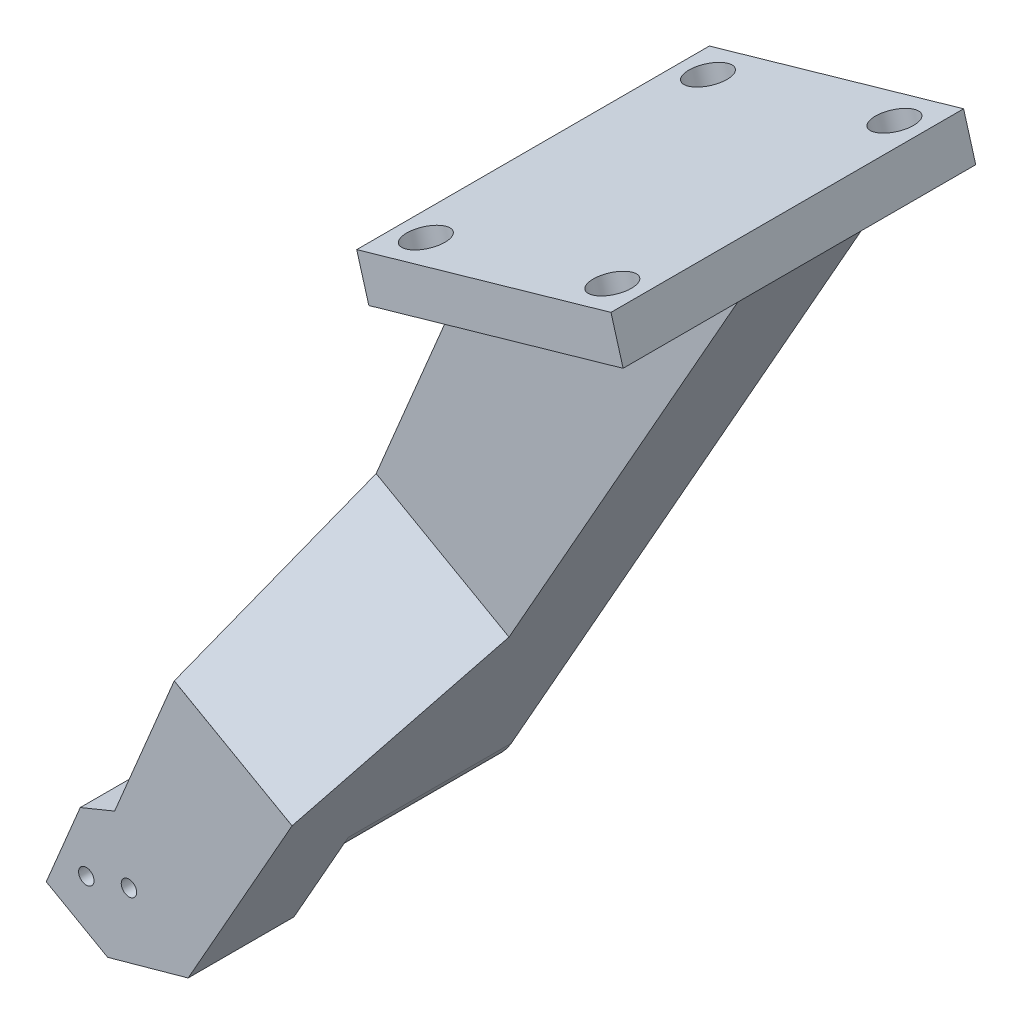
ISO-10303-21;
HEADER;
FILE_DESCRIPTION(('STEP AP214'),'2;1');
FILE_NAME('part.step','',(''),(''),'','','');
FILE_SCHEMA(('AUTOMOTIVE_DESIGN { 1 0 10303 214 1 1 1 1 }'));
ENDSEC;
DATA;
#1=APPLICATION_CONTEXT('core data for automotive mechanical design processes');
#2=APPLICATION_PROTOCOL_DEFINITION('international standard','automotive_design',2000,#1);
#3=PRODUCT_CONTEXT('',#1,'mechanical');
#4=PRODUCT('Part','Part','',(#3));
#5=PRODUCT_RELATED_PRODUCT_CATEGORY('part','',(#4));
#6=PRODUCT_DEFINITION_FORMATION('','',#4);
#7=PRODUCT_DEFINITION_CONTEXT('part definition',#1,'design');
#8=PRODUCT_DEFINITION('design','',#6,#7);
#9=PRODUCT_DEFINITION_SHAPE('','',#8);
#10=(LENGTH_UNIT() NAMED_UNIT(*) SI_UNIT(.MILLI.,.METRE.));
#11=(NAMED_UNIT(*) PLANE_ANGLE_UNIT() SI_UNIT($,.RADIAN.));
#12=(NAMED_UNIT(*) SI_UNIT($,.STERADIAN.) SOLID_ANGLE_UNIT());
#13=UNCERTAINTY_MEASURE_WITH_UNIT(LENGTH_MEASURE(1.E-05),#10,'distance_accuracy_value','');
#14=(GEOMETRIC_REPRESENTATION_CONTEXT(3) GLOBAL_UNCERTAINTY_ASSIGNED_CONTEXT((#13)) GLOBAL_UNIT_ASSIGNED_CONTEXT((#10,
#11,#12)) REPRESENTATION_CONTEXT('',''));
#15=CARTESIAN_POINT('',(0.,0.,0.));
#16=DIRECTION('',(0.,0.,1.));
#17=DIRECTION('',(1.,0.,0.));
#18=AXIS2_PLACEMENT_3D('',#15,#16,#17);
#19=CARTESIAN_POINT('',(27.9355762114051,27.2756145052274,-1.29323704785185));
#20=DIRECTION('',(0.,0.,-1.));
#21=DIRECTION('',(-1.,0.,0.));
#22=AXIS2_PLACEMENT_3D('',#19,#20,#21);
#23=PLANE('',#22);
#24=DIRECTION('',(-0.385881624576734,-0.922548303241635,0.));
#25=VECTOR('',#24,1.);
#26=CARTESIAN_POINT('',(44.8530612739666,85.7177109131975,-1.29323704785185));
#27=LINE('',#26,#25);
#28=CARTESIAN_POINT('',(44.8530612739666,85.7177109131975,-1.29323704785185));
#29=VERTEX_POINT('',#28);
#30=CARTESIAN_POINT('',(32.6840647949093,56.6246255240659,-1.29323704785185));
#31=VERTEX_POINT('',#30);
#32=EDGE_CURVE('E283',#29,#31,#27,.T.);
#33=ORIENTED_EDGE('',*,*,#32,.T.);
#34=DIRECTION('',(0.870454620187236,-0.492248671094899,0.));
#35=VECTOR('',#34,1.);
#36=CARTESIAN_POINT('',(47.7546573277953,48.1020914655643,-1.29323704785185));
#37=LINE('',#36,#35);
#38=CARTESIAN_POINT('',(47.7546573277953,48.1020914655643,-1.29323704785185));
#39=VERTEX_POINT('',#38);
#40=EDGE_CURVE('E57',#31,#39,#37,.T.);
#41=ORIENTED_EDGE('',*,*,#40,.T.);
#42=DIRECTION('',(0.4922486710949,0.870454620187236,0.));
#43=VECTOR('',#42,1.);
#44=CARTESIAN_POINT('',(34.0028772010461,23.7845031204245,-1.29323704785185));
#45=LINE('',#44,#43);
#46=CARTESIAN_POINT('',(73.6949178305699,93.9728493353149,-1.29323704785186));
#47=VERTEX_POINT('',#46);
#48=EDGE_CURVE('E273',#39,#47,#45,.T.);
#49=ORIENTED_EDGE('',*,*,#48,.T.);
#50=DIRECTION('',(-0.961395218553444,-0.275171280737245,0.));
#51=VECTOR('',#50,1.);
#52=CARTESIAN_POINT('',(73.6949178305699,93.9728493353148,-1.29323704785185));
#53=LINE('',#52,#51);
#54=EDGE_CURVE('E280',#47,#29,#53,.T.);
#55=ORIENTED_EDGE('',*,*,#54,.T.);
#56=EDGE_LOOP('',(#33,#41,#49,#55));
#57=FACE_BOUND('',#56,.T.);
#58=ADVANCED_FACE('F35',(#57),#23,.F.);
#59=CARTESIAN_POINT('',(-19.2802398644034,67.3614280114519,1.40701486736754E-13));
#60=DIRECTION('',(0.275171280737245,-0.961395218553444,0.));
#61=DIRECTION('',(0.961395218553444,0.275171280737245,0.));
#62=AXIS2_PLACEMENT_3D('',#59,#60,#61);
#63=PLANE('',#62);
#64=CARTESIAN_POINT('',(48.6986421481804,86.8183960361465,7.70676295214831));
#65=DIRECTION('',(0.275171280737245,-0.961395218553444,0.));
#66=DIRECTION('',(0.961395218553444,0.275171280737245,0.));
#67=AXIS2_PLACEMENT_3D('',#64,#65,#66);
#68=CIRCLE('',#67,2.25000000000001);
#69=CARTESIAN_POINT('',(50.8617813899256,87.4375314178053,7.70676295214831));
#70=VERTEX_POINT('',#69);
#71=EDGE_CURVE('E321',#70,#70,#68,.T.);
#72=ORIENTED_EDGE('',*,*,#71,.F.);
#73=EDGE_LOOP('',(#72));
#74=FACE_BOUND('',#73,.T.);
#75=CARTESIAN_POINT('',(69.8493369563561,92.8721642123659,7.70676295214832));
#76=DIRECTION('',(0.275171280737245,-0.961395218553444,0.));
#77=DIRECTION('',(0.961395218553444,0.275171280737245,0.));
#78=AXIS2_PLACEMENT_3D('',#75,#76,#77);
#79=CIRCLE('',#78,2.25000000000001);
#80=CARTESIAN_POINT('',(72.0124761981014,93.4912995940247,7.70676295214832));
#81=VERTEX_POINT('',#80);
#82=EDGE_CURVE('E327',#81,#81,#79,.T.);
#83=ORIENTED_EDGE('',*,*,#82,.F.);
#84=EDGE_LOOP('',(#83));
#85=FACE_BOUND('',#84,.T.);
#86=DIRECTION('',(0.,0.,-1.));
#87=VECTOR('',#86,1.);
#88=CARTESIAN_POINT('',(44.8530612739666,85.7177109131976,-28.2932370478517));
#89=LINE('',#88,#87);
#90=CARTESIAN_POINT('',(44.8530612739666,85.7177109131975,11.7067629521483));
#91=VERTEX_POINT('',#90);
#92=EDGE_CURVE('E340',#91,#29,#89,.T.);
#93=ORIENTED_EDGE('',*,*,#92,.T.);
#94=ORIENTED_EDGE('',*,*,#54,.F.);
#95=DIRECTION('',(0.,0.,1.));
#96=VECTOR('',#95,1.);
#97=CARTESIAN_POINT('',(73.6949178305699,93.9728493353149,-28.2932370478517));
#98=LINE('',#97,#96);
#99=CARTESIAN_POINT('',(73.6949178305699,93.9728493353149,11.7067629521483));
#100=VERTEX_POINT('',#99);
#101=EDGE_CURVE('E337',#47,#100,#98,.T.);
#102=ORIENTED_EDGE('',*,*,#101,.T.);
#103=DIRECTION('',(-0.961395218553444,-0.275171280737245,0.));
#104=VECTOR('',#103,1.);
#105=CARTESIAN_POINT('',(73.6949178305699,93.9728493353149,11.7067629521483));
#106=LINE('',#105,#104);
#107=EDGE_CURVE('E336',#100,#91,#106,.T.);
#108=ORIENTED_EDGE('',*,*,#107,.T.);
#109=EDGE_LOOP('',(#93,#94,#102,#108));
#110=FACE_BOUND('',#109,.T.);
#111=ADVANCED_FACE('F423',(#74,#85,#110),#63,.T.);
#112=DIRECTION('',(-0.961395218553444,-0.275171280737245,0.));
#113=VECTOR('',#112,1.);
#114=CARTESIAN_POINT('',(73.6949178305699,93.9728493353148,-15.2932370478519));
#115=LINE('',#114,#113);
#116=CARTESIAN_POINT('',(73.6949178305699,93.9728493353149,-15.2932370478519));
#117=VERTEX_POINT('',#116);
#118=CARTESIAN_POINT('',(44.8530612739666,85.7177109131975,-15.2932370478519));
#119=VERTEX_POINT('',#118);
#120=EDGE_CURVE('E288',#117,#119,#115,.T.);
#121=ORIENTED_EDGE('',*,*,#120,.T.);
#122=CARTESIAN_POINT('',(44.8530612739666,85.7177109131976,-28.2932370478517));
#123=VERTEX_POINT('',#122);
#124=EDGE_CURVE('E339',#119,#123,#89,.T.);
#125=ORIENTED_EDGE('',*,*,#124,.T.);
#126=DIRECTION('',(0.961395218553444,0.275171280737245,0.));
#127=VECTOR('',#126,1.);
#128=CARTESIAN_POINT('',(73.6949178305699,93.9728493353149,-28.2932370478517));
#129=LINE('',#128,#127);
#130=CARTESIAN_POINT('',(73.6949178305699,93.9728493353149,-28.2932370478517));
#131=VERTEX_POINT('',#130);
#132=EDGE_CURVE('E343',#123,#131,#129,.T.);
#133=ORIENTED_EDGE('',*,*,#132,.T.);
#134=EDGE_CURVE('E333',#131,#117,#98,.T.);
#135=ORIENTED_EDGE('',*,*,#134,.T.);
#136=EDGE_LOOP('',(#121,#125,#133,#135));
#137=FACE_BOUND('',#136,.T.);
#138=CARTESIAN_POINT('',(69.8493369563561,92.8721642123659,-24.2932370478517));
#139=DIRECTION('',(0.275171280737245,-0.961395218553444,0.));
#140=DIRECTION('',(0.961395218553444,0.275171280737245,0.));
#141=AXIS2_PLACEMENT_3D('',#138,#139,#140);
#142=CIRCLE('',#141,2.25000000000002);
#143=CARTESIAN_POINT('',(72.0124761981014,93.4912995940248,-24.2932370478517));
#144=VERTEX_POINT('',#143);
#145=EDGE_CURVE('E315',#144,#144,#142,.T.);
#146=ORIENTED_EDGE('',*,*,#145,.F.);
#147=EDGE_LOOP('',(#146));
#148=FACE_BOUND('',#147,.T.);
#149=CARTESIAN_POINT('',(48.6986421481804,86.8183960361466,-24.2932370478517));
#150=DIRECTION('',(0.275171280737245,-0.961395218553444,0.));
#151=DIRECTION('',(0.961395218553444,0.275171280737245,0.));
#152=AXIS2_PLACEMENT_3D('',#149,#150,#151);
#153=CIRCLE('',#152,2.25000000000001);
#154=CARTESIAN_POINT('',(50.8617813899256,87.4375314178054,-24.2932370478517));
#155=VERTEX_POINT('',#154);
#156=EDGE_CURVE('E309',#155,#155,#153,.T.);
#157=ORIENTED_EDGE('',*,*,#156,.F.);
#158=EDGE_LOOP('',(#157));
#159=FACE_BOUND('',#158,.T.);
#160=ADVANCED_FACE('F428',(#137,#148,#159),#63,.T.);
#161=CARTESIAN_POINT('',(-20.6560962680896,72.1684041042191,1.50230669788044E-13));
#162=DIRECTION('',(0.275171280737245,-0.961395218553444,0.));
#163=DIRECTION('',(0.961395218553444,0.275171280737245,0.));
#164=AXIS2_PLACEMENT_3D('',#161,#162,#163);
#165=PLANE('',#164);
#166=DIRECTION('',(0.,0.,1.));
#167=VECTOR('',#166,1.);
#168=CARTESIAN_POINT('',(72.3190614268837,98.7798254280821,-28.2932370478517));
#169=LINE('',#168,#167);
#170=CARTESIAN_POINT('',(72.3190614268837,98.7798254280821,-28.2932370478517));
#171=VERTEX_POINT('',#170);
#172=CARTESIAN_POINT('',(72.3190614268837,98.7798254280821,11.7067629521483));
#173=VERTEX_POINT('',#172);
#174=EDGE_CURVE('E330',#171,#173,#169,.T.);
#175=ORIENTED_EDGE('',*,*,#174,.F.);
#176=DIRECTION('',(0.961395218553444,0.275171280737245,0.));
#177=VECTOR('',#176,1.);
#178=CARTESIAN_POINT('',(72.3190614268837,98.7798254280821,-28.2932370478517));
#179=LINE('',#178,#177);
#180=CARTESIAN_POINT('',(43.4772048702804,90.5246870059648,-28.2932370478517));
#181=VERTEX_POINT('',#180);
#182=EDGE_CURVE('E352',#181,#171,#179,.T.);
#183=ORIENTED_EDGE('',*,*,#182,.F.);
#184=DIRECTION('',(0.,0.,-1.));
#185=VECTOR('',#184,1.);
#186=CARTESIAN_POINT('',(43.4772048702804,90.5246870059648,-28.2932370478517));
#187=LINE('',#186,#185);
#188=CARTESIAN_POINT('',(43.4772048702804,90.5246870059647,11.7067629521483));
#189=VERTEX_POINT('',#188);
#190=EDGE_CURVE('E350',#189,#181,#187,.T.);
#191=ORIENTED_EDGE('',*,*,#190,.F.);
#192=DIRECTION('',(-0.961395218553444,-0.275171280737245,0.));
#193=VECTOR('',#192,1.);
#194=CARTESIAN_POINT('',(72.3190614268837,98.7798254280821,11.7067629521483));
#195=LINE('',#194,#193);
#196=EDGE_CURVE('E348',#173,#189,#195,.T.);
#197=ORIENTED_EDGE('',*,*,#196,.F.);
#198=EDGE_LOOP('',(#175,#183,#191,#197));
#199=FACE_BOUND('',#198,.T.);
#200=CARTESIAN_POINT('',(68.4734805526699,97.6791403051331,7.70676295214833));
#201=DIRECTION('',(0.275171280737245,-0.961395218553444,0.));
#202=DIRECTION('',(0.961395218553444,0.275171280737245,0.));
#203=AXIS2_PLACEMENT_3D('',#200,#201,#202);
#204=CIRCLE('',#203,2.25000000000001);
#205=CARTESIAN_POINT('',(70.6366197944152,98.2982756867919,7.70676295214833));
#206=VERTEX_POINT('',#205);
#207=EDGE_CURVE('E324',#206,#206,#204,.T.);
#208=ORIENTED_EDGE('',*,*,#207,.T.);
#209=EDGE_LOOP('',(#208));
#210=FACE_BOUND('',#209,.T.);
#211=CARTESIAN_POINT('',(47.3227857444941,91.6253721289137,7.70676295214832));
#212=DIRECTION('',(0.275171280737245,-0.961395218553444,0.));
#213=DIRECTION('',(0.961395218553444,0.275171280737245,0.));
#214=AXIS2_PLACEMENT_3D('',#211,#212,#213);
#215=CIRCLE('',#214,2.25000000000001);
#216=CARTESIAN_POINT('',(49.4859249862394,92.2445075105725,7.70676295214832));
#217=VERTEX_POINT('',#216);
#218=EDGE_CURVE('E318',#217,#217,#215,.T.);
#219=ORIENTED_EDGE('',*,*,#218,.T.);
#220=EDGE_LOOP('',(#219));
#221=FACE_BOUND('',#220,.T.);
#222=CARTESIAN_POINT('',(68.4734805526699,97.6791403051332,-24.2932370478517));
#223=DIRECTION('',(0.275171280737245,-0.961395218553444,0.));
#224=DIRECTION('',(0.961395218553444,0.275171280737245,0.));
#225=AXIS2_PLACEMENT_3D('',#222,#223,#224);
#226=CIRCLE('',#225,2.25000000000002);
#227=CARTESIAN_POINT('',(70.6366197944152,98.298275686792,-24.2932370478517));
#228=VERTEX_POINT('',#227);
#229=EDGE_CURVE('E312',#228,#228,#226,.T.);
#230=ORIENTED_EDGE('',*,*,#229,.T.);
#231=EDGE_LOOP('',(#230));
#232=FACE_BOUND('',#231,.T.);
#233=CARTESIAN_POINT('',(47.3227857444941,91.6253721289138,-24.2932370478517));
#234=DIRECTION('',(0.275171280737245,-0.961395218553444,0.));
#235=DIRECTION('',(0.961395218553444,0.275171280737245,0.));
#236=AXIS2_PLACEMENT_3D('',#233,#234,#235);
#237=CIRCLE('',#236,2.25000000000001);
#238=CARTESIAN_POINT('',(49.4859249862394,92.2445075105726,-24.2932370478517));
#239=VERTEX_POINT('',#238);
#240=EDGE_CURVE('E301',#239,#239,#237,.T.);
#241=ORIENTED_EDGE('',*,*,#240,.T.);
#242=EDGE_LOOP('',(#241));
#243=FACE_BOUND('',#242,.T.);
#244=ADVANCED_FACE('F463',(#199,#210,#221,#232,#243),#165,.F.);
#245=CARTESIAN_POINT('',(73.6949178305699,93.9728493353149,-28.2932370478517));
#246=DIRECTION('',(-0.961395218553444,-0.275171280737245,0.));
#247=DIRECTION('',(0.275171280737245,-0.961395218553444,0.));
#248=AXIS2_PLACEMENT_3D('',#245,#246,#247);
#249=PLANE('',#248);
#250=ORIENTED_EDGE('',*,*,#174,.T.);
#251=DIRECTION('',(-0.275171280737245,0.961395218553444,0.));
#252=VECTOR('',#251,1.);
#253=CARTESIAN_POINT('',(73.6949178305699,93.9728493353149,11.7067629521483));
#254=LINE('',#253,#252);
#255=EDGE_CURVE('E362',#100,#173,#254,.T.);
#256=ORIENTED_EDGE('',*,*,#255,.F.);
#257=ORIENTED_EDGE('',*,*,#101,.F.);
#258=DIRECTION('',(0.,0.,1.));
#259=VECTOR('',#258,1.);
#260=CARTESIAN_POINT('',(73.6949178305699,93.9728493353148,-15.2932370478519));
#261=LINE('',#260,#259);
#262=EDGE_CURVE('E297',#117,#47,#261,.T.);
#263=ORIENTED_EDGE('',*,*,#262,.F.);
#264=ORIENTED_EDGE('',*,*,#134,.F.);
#265=DIRECTION('',(-0.275171280737245,0.961395218553444,0.));
#266=VECTOR('',#265,1.);
#267=CARTESIAN_POINT('',(73.6949178305699,93.9728493353149,-28.2932370478517));
#268=LINE('',#267,#266);
#269=EDGE_CURVE('E345',#131,#171,#268,.T.);
#270=ORIENTED_EDGE('',*,*,#269,.T.);
#271=EDGE_LOOP('',(#250,#256,#257,#263,#264,#270));
#272=FACE_BOUND('',#271,.T.);
#273=ADVANCED_FACE('F467',(#272),#249,.F.);
#274=CARTESIAN_POINT('',(73.6949178305699,93.9728493353149,11.7067629521483));
#275=DIRECTION('',(0.,0.,-1.));
#276=DIRECTION('',(0.,1.,0.));
#277=AXIS2_PLACEMENT_3D('',#274,#275,#276);
#278=PLANE('',#277);
#279=ORIENTED_EDGE('',*,*,#196,.T.);
#280=DIRECTION('',(-0.275171280737245,0.961395218553444,0.));
#281=VECTOR('',#280,1.);
#282=CARTESIAN_POINT('',(44.8530612739666,85.7177109131975,11.7067629521483));
#283=LINE('',#282,#281);
#284=EDGE_CURVE('E359',#91,#189,#283,.T.);
#285=ORIENTED_EDGE('',*,*,#284,.F.);
#286=ORIENTED_EDGE('',*,*,#107,.F.);
#287=ORIENTED_EDGE('',*,*,#255,.T.);
#288=EDGE_LOOP('',(#279,#285,#286,#287));
#289=FACE_BOUND('',#288,.T.);
#290=ADVANCED_FACE('F475',(#289),#278,.F.);
#291=CARTESIAN_POINT('',(44.8530612739666,85.7177109131976,-28.2932370478517));
#292=DIRECTION('',(0.961395218553444,0.275171280737245,0.));
#293=DIRECTION('',(-0.275171280737245,0.961395218553444,0.));
#294=AXIS2_PLACEMENT_3D('',#291,#292,#293);
#295=PLANE('',#294);
#296=ORIENTED_EDGE('',*,*,#190,.T.);
#297=DIRECTION('',(-0.275171280737245,0.961395218553444,0.));
#298=VECTOR('',#297,1.);
#299=CARTESIAN_POINT('',(44.8530612739666,85.7177109131976,-28.2932370478517));
#300=LINE('',#299,#298);
#301=EDGE_CURVE('E356',#123,#181,#300,.T.);
#302=ORIENTED_EDGE('',*,*,#301,.F.);
#303=ORIENTED_EDGE('',*,*,#124,.F.);
#304=DIRECTION('',(0.,0.,1.));
#305=VECTOR('',#304,1.);
#306=CARTESIAN_POINT('',(44.8530612739666,85.7177109131975,-15.2932370478519));
#307=LINE('',#306,#305);
#308=EDGE_CURVE('E305',#119,#29,#307,.T.);
#309=ORIENTED_EDGE('',*,*,#308,.T.);
#310=ORIENTED_EDGE('',*,*,#92,.F.);
#311=ORIENTED_EDGE('',*,*,#284,.T.);
#312=EDGE_LOOP('',(#296,#302,#303,#309,#310,#311));
#313=FACE_BOUND('',#312,.T.);
#314=ADVANCED_FACE('F471',(#313),#295,.F.);
#315=CARTESIAN_POINT('',(73.6949178305699,93.9728493353149,-28.2932370478517));
#316=DIRECTION('',(0.,0.,1.));
#317=DIRECTION('',(0.,-1.,0.));
#318=AXIS2_PLACEMENT_3D('',#315,#316,#317);
#319=PLANE('',#318);
#320=ORIENTED_EDGE('',*,*,#182,.T.);
#321=ORIENTED_EDGE('',*,*,#269,.F.);
#322=ORIENTED_EDGE('',*,*,#132,.F.);
#323=ORIENTED_EDGE('',*,*,#301,.T.);
#324=EDGE_LOOP('',(#320,#321,#322,#323));
#325=FACE_BOUND('',#324,.T.);
#326=ADVANCED_FACE('F459',(#325),#319,.F.);
#327=CARTESIAN_POINT('',(69.8493369563561,92.8721642123659,7.70676295214832));
#328=DIRECTION('',(-0.275171280737245,0.961395218553444,0.));
#329=DIRECTION('',(-0.961395218553444,-0.275171280737245,0.));
#330=AXIS2_PLACEMENT_3D('',#327,#328,#329);
#331=CYLINDRICAL_SURFACE('',#330,2.25000000000001);
#332=ORIENTED_EDGE('',*,*,#82,.T.);
#333=EDGE_LOOP('',(#332));
#334=FACE_BOUND('',#333,.T.);
#335=ORIENTED_EDGE('',*,*,#207,.F.);
#336=EDGE_LOOP('',(#335));
#337=FACE_BOUND('',#336,.T.);
#338=ADVANCED_FACE('F456',(#334,#337),#331,.F.);
#339=CARTESIAN_POINT('',(48.6986421481804,86.8183960361465,7.70676295214831));
#340=DIRECTION('',(-0.275171280737245,0.961395218553444,0.));
#341=DIRECTION('',(-0.961395218553444,-0.275171280737245,0.));
#342=AXIS2_PLACEMENT_3D('',#339,#340,#341);
#343=CYLINDRICAL_SURFACE('',#342,2.25000000000001);
#344=ORIENTED_EDGE('',*,*,#71,.T.);
#345=EDGE_LOOP('',(#344));
#346=FACE_BOUND('',#345,.T.);
#347=ORIENTED_EDGE('',*,*,#218,.F.);
#348=EDGE_LOOP('',(#347));
#349=FACE_BOUND('',#348,.T.);
#350=ADVANCED_FACE('F452',(#346,#349),#343,.F.);
#351=CARTESIAN_POINT('',(69.8493369563561,92.8721642123659,-24.2932370478517));
#352=DIRECTION('',(-0.275171280737245,0.961395218553444,0.));
#353=DIRECTION('',(-0.961395218553444,-0.275171280737245,0.));
#354=AXIS2_PLACEMENT_3D('',#351,#352,#353);
#355=CYLINDRICAL_SURFACE('',#354,2.25000000000002);
#356=ORIENTED_EDGE('',*,*,#145,.T.);
#357=EDGE_LOOP('',(#356));
#358=FACE_BOUND('',#357,.T.);
#359=ORIENTED_EDGE('',*,*,#229,.F.);
#360=EDGE_LOOP('',(#359));
#361=FACE_BOUND('',#360,.T.);
#362=ADVANCED_FACE('F448',(#358,#361),#355,.F.);
#363=CARTESIAN_POINT('',(48.6986421481804,86.8183960361466,-24.2932370478517));
#364=DIRECTION('',(-0.275171280737245,0.961395218553444,0.));
#365=DIRECTION('',(-0.961395218553444,-0.275171280737245,0.));
#366=AXIS2_PLACEMENT_3D('',#363,#364,#365);
#367=CYLINDRICAL_SURFACE('',#366,2.25000000000001);
#368=ORIENTED_EDGE('',*,*,#156,.T.);
#369=EDGE_LOOP('',(#368));
#370=FACE_BOUND('',#369,.T.);
#371=ORIENTED_EDGE('',*,*,#240,.F.);
#372=EDGE_LOOP('',(#371));
#373=FACE_BOUND('',#372,.T.);
#374=ADVANCED_FACE('F445',(#370,#373),#367,.F.);
#375=CARTESIAN_POINT('',(34.0028772010461,23.7845031204245,-15.2932370478519));
#376=DIRECTION('',(0.870454620187236,-0.4922486710949,0.));
#377=DIRECTION('',(0.4922486710949,0.870454620187236,0.));
#378=AXIS2_PLACEMENT_3D('',#375,#376,#377);
#379=PLANE('',#378);
#380=ORIENTED_EDGE('',*,*,#262,.T.);
#381=ORIENTED_EDGE('',*,*,#48,.F.);
#382=DIRECTION('',(0.348072373361268,0.615504364649552,-0.707106781186551));
#383=VECTOR('',#382,1.);
#384=CARTESIAN_POINT('',(39.6374767414405,33.7482947786768,15.1967629521483));
#385=LINE('',#384,#383);
#386=CARTESIAN_POINT('',(39.6374767414405,33.7482947786768,15.1967629521483));
#387=VERTEX_POINT('',#386);
#388=EDGE_CURVE('E12',#39,#387,#385,.F.);
#389=ORIENTED_EDGE('',*,*,#388,.T.);
#390=DIRECTION('',(0.,0.,-1.));
#391=VECTOR('',#390,1.);
#392=CARTESIAN_POINT('',(39.6374767414405,33.7482947786768,31.3419401448969));
#393=LINE('',#392,#391);
#394=CARTESIAN_POINT('',(39.6374767414405,33.7482947786768,15.2));
#395=VERTEX_POINT('',#394);
#396=EDGE_CURVE('E275',#395,#387,#393,.T.);
#397=ORIENTED_EDGE('',*,*,#396,.F.);
#398=DIRECTION('',(0.4922486710949,0.870454620187236,0.));
#399=VECTOR('',#398,1.);
#400=CARTESIAN_POINT('',(39.6374767414405,33.7482947786768,15.2));
#401=LINE('',#400,#399);
#402=CARTESIAN_POINT('',(27.8513325024595,12.9065854771674,15.2));
#403=VERTEX_POINT('',#402);
#404=EDGE_CURVE('E202',#403,#395,#401,.T.);
#405=ORIENTED_EDGE('',*,*,#404,.F.);
#406=DIRECTION('',(0.,0.,-1.));
#407=VECTOR('',#406,1.);
#408=CARTESIAN_POINT('',(27.8513325024596,12.9065854771676,45.142382163759));
#409=LINE('',#408,#407);
#410=CARTESIAN_POINT('',(27.8513325024596,12.9065854771676,3.19999999999997));
#411=VERTEX_POINT('',#410);
#412=EDGE_CURVE('E187',#403,#411,#409,.T.);
#413=ORIENTED_EDGE('',*,*,#412,.T.);
#414=DIRECTION('',(-0.492248671094899,-0.870454620187236,0.));
#415=VECTOR('',#414,1.);
#416=CARTESIAN_POINT('',(39.6374767414405,33.7482947786768,3.19999999999997));
#417=LINE('',#416,#415);
#418=CARTESIAN_POINT('',(34.0028772010461,23.7845031204244,3.19999999999998));
#419=VERTEX_POINT('',#418);
#420=EDGE_CURVE('E251',#419,#411,#417,.T.);
#421=ORIENTED_EDGE('',*,*,#420,.F.);
#422=DIRECTION('',(0.,0.,1.));
#423=VECTOR('',#422,1.);
#424=CARTESIAN_POINT('',(34.0028772010461,23.7845031204245,-15.2932370478519));
#425=LINE('',#424,#423);
#426=CARTESIAN_POINT('',(34.0028772010461,23.7845031204245,-15.2932370478519));
#427=VERTEX_POINT('',#426);
#428=EDGE_CURVE('E298',#427,#419,#425,.T.);
#429=ORIENTED_EDGE('',*,*,#428,.F.);
#430=DIRECTION('',(0.4922486710949,0.870454620187236,0.));
#431=VECTOR('',#430,1.);
#432=CARTESIAN_POINT('',(34.0028772010461,23.7845031204245,-15.2932370478519));
#433=LINE('',#432,#431);
#434=EDGE_CURVE('E285',#427,#117,#433,.T.);
#435=ORIENTED_EDGE('',*,*,#434,.T.);
#436=EDGE_LOOP('',(#380,#381,#389,#397,#405,#413,#421,#429,#435));
#437=FACE_BOUND('',#436,.T.);
#438=ADVANCED_FACE('F385',(#437),#379,.T.);
#439=CARTESIAN_POINT('',(27.9355762114051,27.2756145052274,-15.2932370478519));
#440=DIRECTION('',(0.,0.,1.));
#441=DIRECTION('',(1.,0.,0.));
#442=AXIS2_PLACEMENT_3D('',#439,#440,#441);
#443=CYLINDRICAL_SURFACE('',#442,7.);
#444=ORIENTED_EDGE('',*,*,#428,.T.);
#445=CARTESIAN_POINT('',(27.9355762114051,27.2756145052274,3.19999999999998));
#446=DIRECTION('',(0.,0.,-1.));
#447=DIRECTION('',(0.,1.,0.));
#448=AXIS2_PLACEMENT_3D('',#445,#446,#447);
#449=CIRCLE('',#448,7.);
#450=CARTESIAN_POINT('',(21.1895411467796,29.144039217878,3.19999999999997));
#451=VERTEX_POINT('',#450);
#452=EDGE_CURVE('E274',#451,#419,#449,.F.);
#453=ORIENTED_EDGE('',*,*,#452,.F.);
#454=CARTESIAN_POINT('',(21.868275221764,30.7667258900304,3.19999999999997));
#455=VERTEX_POINT('',#454);
#456=EDGE_CURVE('E270',#455,#451,#449,.F.);
#457=ORIENTED_EDGE('',*,*,#456,.F.);
#458=DIRECTION('',(0.,0.,1.));
#459=VECTOR('',#458,1.);
#460=CARTESIAN_POINT('',(21.868275221764,30.7667258900304,-15.2932370478519));
#461=LINE('',#460,#459);
#462=CARTESIAN_POINT('',(21.868275221764,30.7667258900304,-15.2932370478519));
#463=VERTEX_POINT('',#462);
#464=EDGE_CURVE('E302',#463,#455,#461,.T.);
#465=ORIENTED_EDGE('',*,*,#464,.F.);
#466=CARTESIAN_POINT('',(27.9355762114051,27.2756145052274,-15.2932370478519));
#467=DIRECTION('',(0.,0.,1.));
#468=DIRECTION('',(-1.,0.,0.));
#469=AXIS2_PLACEMENT_3D('',#466,#467,#468);
#470=CIRCLE('',#469,7.);
#471=EDGE_CURVE('E294',#463,#427,#470,.T.);
#472=ORIENTED_EDGE('',*,*,#471,.T.);
#473=EDGE_LOOP('',(#444,#453,#457,#465,#472));
#474=FACE_BOUND('',#473,.T.);
#475=ADVANCED_FACE('F380',(#474),#443,.T.);
#476=CARTESIAN_POINT('',(44.8530612739666,85.7177109131975,-15.2932370478519));
#477=DIRECTION('',(-0.922548303241635,0.385881624576734,0.));
#478=DIRECTION('',(-0.385881624576734,-0.922548303241635,0.));
#479=AXIS2_PLACEMENT_3D('',#476,#477,#478);
#480=PLANE('',#479);
#481=ORIENTED_EDGE('',*,*,#464,.T.);
#482=DIRECTION('',(0.385881624576735,0.922548303241635,0.));
#483=VECTOR('',#482,1.);
#484=CARTESIAN_POINT('',(17.5739630932275,20.5000790339722,3.19999999999997));
#485=LINE('',#484,#483);
#486=EDGE_CURVE('E252',#451,#455,#485,.T.);
#487=ORIENTED_EDGE('',*,*,#486,.F.);
#488=CARTESIAN_POINT('',(17.5739630932275,20.5000790339722,3.19999999999997));
#489=VERTEX_POINT('',#488);
#490=EDGE_CURVE('E248',#489,#451,#485,.T.);
#491=ORIENTED_EDGE('',*,*,#490,.F.);
#492=DIRECTION('',(0.,0.,-1.));
#493=VECTOR('',#492,1.);
#494=CARTESIAN_POINT('',(17.5739630932275,20.5000790339722,45.142382163759));
#495=LINE('',#494,#493);
#496=CARTESIAN_POINT('',(17.5739630932275,20.5000790339722,5.19999999999998));
#497=VERTEX_POINT('',#496);
#498=EDGE_CURVE('E264',#497,#489,#495,.T.);
#499=ORIENTED_EDGE('',*,*,#498,.F.);
#500=DIRECTION('',(-0.385881624576735,-0.922548303241635,0.));
#501=VECTOR('',#500,1.);
#502=CARTESIAN_POINT('',(17.5739630932275,20.5000790339722,5.19999999999998));
#503=LINE('',#502,#501);
#504=CARTESIAN_POINT('',(19.512348726129,25.1342835743485,5.19999999999998));
#505=VERTEX_POINT('',#504);
#506=EDGE_CURVE('E232',#505,#497,#503,.T.);
#507=ORIENTED_EDGE('',*,*,#506,.F.);
#508=DIRECTION('',(0.,0.,-1.));
#509=VECTOR('',#508,1.);
#510=CARTESIAN_POINT('',(19.5123487261327,25.13428357435,15.2));
#511=LINE('',#510,#509);
#512=CARTESIAN_POINT('',(19.5123487261327,25.13428357435,15.2));
#513=VERTEX_POINT('',#512);
#514=EDGE_CURVE('E228',#513,#505,#511,.T.);
#515=ORIENTED_EDGE('',*,*,#514,.F.);
#516=DIRECTION('',(-0.385881624576586,-0.922548303241698,0.));
#517=VECTOR('',#516,1.);
#518=CARTESIAN_POINT('',(19.5123487261327,25.13428357435,15.2));
#519=LINE('',#518,#517);
#520=CARTESIAN_POINT('',(26.2759311159559,41.3043498852645,15.2));
#521=VERTEX_POINT('',#520);
#522=EDGE_CURVE('E210',#521,#513,#519,.T.);
#523=ORIENTED_EDGE('',*,*,#522,.F.);
#524=DIRECTION('',(0.,0.,-1.));
#525=VECTOR('',#524,1.);
#526=CARTESIAN_POINT('',(26.2759311159559,41.3043498852645,31.3419401448969));
#527=LINE('',#526,#525);
#528=CARTESIAN_POINT('',(26.2759311159559,41.3043498852645,15.1967629521483));
#529=VERTEX_POINT('',#528);
#530=EDGE_CURVE('E269',#521,#529,#527,.T.);
#531=ORIENTED_EDGE('',*,*,#530,.T.);
#532=DIRECTION('',(-0.273818083283008,-0.654631866460858,0.704613920300467));
#533=VECTOR('',#532,1.);
#534=CARTESIAN_POINT('',(25.9233077379724,40.4613138910038,16.104165917546));
#535=LINE('',#534,#533);
#536=EDGE_CURVE('E44',#529,#31,#535,.F.);
#537=ORIENTED_EDGE('',*,*,#536,.T.);
#538=ORIENTED_EDGE('',*,*,#32,.F.);
#539=ORIENTED_EDGE('',*,*,#308,.F.);
#540=DIRECTION('',(-0.385881624576734,-0.922548303241635,0.));
#541=VECTOR('',#540,1.);
#542=CARTESIAN_POINT('',(44.8530612739666,85.7177109131975,-15.2932370478519));
#543=LINE('',#542,#541);
#544=EDGE_CURVE('E291',#119,#463,#543,.T.);
#545=ORIENTED_EDGE('',*,*,#544,.T.);
#546=EDGE_LOOP('',(#481,#487,#491,#499,#507,#515,#523,#531,#537,#538,#539,#545));
#547=FACE_BOUND('',#546,.T.);
#548=ADVANCED_FACE('F374',(#547),#480,.T.);
#549=CARTESIAN_POINT('',(27.9355762114051,27.2756145052274,-15.2932370478519));
#550=DIRECTION('',(0.,0.,-1.));
#551=DIRECTION('',(-1.,0.,0.));
#552=AXIS2_PLACEMENT_3D('',#549,#550,#551);
#553=PLANE('',#552);
#554=ORIENTED_EDGE('',*,*,#434,.F.);
#555=ORIENTED_EDGE('',*,*,#471,.F.);
#556=ORIENTED_EDGE('',*,*,#544,.F.);
#557=ORIENTED_EDGE('',*,*,#120,.F.);
#558=EDGE_LOOP('',(#554,#555,#556,#557));
#559=FACE_BOUND('',#558,.T.);
#560=ADVANCED_FACE('F435',(#559),#553,.T.);
#561=CARTESIAN_POINT('',(39.6374767414405,33.7482947786768,31.3419401448969));
#562=DIRECTION('',(-0.492248671094899,-0.870454620187236,0.));
#563=DIRECTION('',(0.870454620187236,-0.492248671094899,0.));
#564=AXIS2_PLACEMENT_3D('',#561,#562,#563);
#565=PLANE('',#564);
#566=ORIENTED_EDGE('',*,*,#396,.T.);
#567=DIRECTION('',(-0.870454620187236,0.492248671094899,0.));
#568=VECTOR('',#567,1.);
#569=CARTESIAN_POINT('',(26.2759311159559,41.3043498852645,15.1967629521483));
#570=LINE('',#569,#568);
#571=EDGE_CURVE('E365',#387,#529,#570,.T.);
#572=ORIENTED_EDGE('',*,*,#571,.T.);
#573=ORIENTED_EDGE('',*,*,#530,.F.);
#574=DIRECTION('',(-0.870454620187236,0.492248671094899,0.));
#575=VECTOR('',#574,1.);
#576=CARTESIAN_POINT('',(26.2759311159559,41.3043498852645,15.2));
#577=LINE('',#576,#575);
#578=EDGE_CURVE('E204',#395,#521,#577,.T.);
#579=ORIENTED_EDGE('',*,*,#578,.F.);
#580=EDGE_LOOP('',(#566,#572,#573,#579));
#581=FACE_BOUND('',#580,.T.);
#582=ADVANCED_FACE('F433',(#581),#565,.F.);
#583=CARTESIAN_POINT('',(5.90000000000052,14.3999999999992,3.19999999999998));
#584=DIRECTION('',(0.,0.,-1.));
#585=DIRECTION('',(0.967330584238884,0.253518324379242,0.));
#586=AXIS2_PLACEMENT_3D('',#583,#584,#585);
#587=PLANE('',#586);
#588=ORIENTED_EDGE('',*,*,#456,.T.);
#589=ORIENTED_EDGE('',*,*,#486,.T.);
#590=EDGE_LOOP('',(#588,#589));
#591=FACE_BOUND('',#590,.T.);
#592=ADVANCED_FACE('F371',(#591),#587,.F.);
#593=CARTESIAN_POINT('',(21.1354567017629,18.3929136089721,3.19999999999997));
#594=DIRECTION('',(0.,0.,1.));
#595=DIRECTION('',(1.,0.,0.));
#596=AXIS2_PLACEMENT_3D('',#593,#594,#595);
#597=PLANE('',#596);
#598=ORIENTED_EDGE('',*,*,#490,.T.);
#599=ORIENTED_EDGE('',*,*,#452,.T.);
#600=ORIENTED_EDGE('',*,*,#420,.T.);
#601=DIRECTION('',(0.963576738010824,0.267431991288291,0.));
#602=VECTOR('',#601,1.);
#603=CARTESIAN_POINT('',(18.7194110529346,10.3721034362497,3.19999999999997));
#604=LINE('',#603,#602);
#605=CARTESIAN_POINT('',(18.7194110529346,10.3721034362497,3.19999999999997));
#606=VERTEX_POINT('',#605);
#607=EDGE_CURVE('E254',#606,#411,#604,.T.);
#608=ORIENTED_EDGE('',*,*,#607,.F.);
#609=DIRECTION('',(0.870454620187236,-0.492248671094899,0.));
#610=VECTOR('',#609,1.);
#611=CARTESIAN_POINT('',(14.3671379519984,12.8333467917242,3.19999999999997));
#612=LINE('',#611,#610);
#613=CARTESIAN_POINT('',(14.3671379519984,12.8333467917242,3.19999999999997));
#614=VERTEX_POINT('',#613);
#615=EDGE_CURVE('E181',#614,#606,#612,.T.);
#616=ORIENTED_EDGE('',*,*,#615,.F.);
#617=DIRECTION('',(0.921755516805521,0.38777154000595,0.));
#618=VECTOR('',#617,1.);
#619=CARTESIAN_POINT('',(14.3671379519984,12.8333467917242,3.19999999999997));
#620=LINE('',#619,#618);
#621=CARTESIAN_POINT('',(22.1048855517778,16.0885248169584,3.19999999999997));
#622=VERTEX_POINT('',#621);
#623=EDGE_CURVE('E257',#614,#622,#620,.T.);
#624=ORIENTED_EDGE('',*,*,#623,.T.);
#625=CARTESIAN_POINT('',(21.1354567017629,18.3929136089721,3.19999999999997));
#626=DIRECTION('',(0.,0.,1.));
#627=DIRECTION('',(1.,0.,0.));
#628=AXIS2_PLACEMENT_3D('',#625,#626,#627);
#629=CIRCLE('',#628,2.50000000000001);
#630=CARTESIAN_POINT('',(20.8500338675125,20.8765669273097,3.19999999999997));
#631=VERTEX_POINT('',#630);
#632=EDGE_CURVE('E231',#622,#631,#629,.T.);
#633=ORIENTED_EDGE('',*,*,#632,.T.);
#634=DIRECTION('',(-0.993461327334967,-0.114169133700165,0.));
#635=VECTOR('',#634,1.);
#636=CARTESIAN_POINT('',(20.8500338675125,20.8765669273097,3.19999999999997));
#637=LINE('',#636,#635);
#638=EDGE_CURVE('E245',#631,#489,#637,.T.);
#639=ORIENTED_EDGE('',*,*,#638,.T.);
#640=EDGE_LOOP('',(#598,#599,#600,#608,#616,#624,#633,#639));
#641=FACE_BOUND('',#640,.T.);
#642=ADVANCED_FACE('F383',(#641),#597,.F.);
#643=CARTESIAN_POINT('',(21.1354567017629,18.3929136089721,45.142382163759));
#644=DIRECTION('',(0.,0.,-1.));
#645=DIRECTION('',(-1.,0.,0.));
#646=AXIS2_PLACEMENT_3D('',#643,#644,#645);
#647=CYLINDRICAL_SURFACE('',#646,2.50000000000001);
#648=CARTESIAN_POINT('',(21.1354567017629,18.3929136089721,5.19999999999998));
#649=DIRECTION('',(0.,0.,-1.));
#650=DIRECTION('',(0.,1.,0.));
#651=AXIS2_PLACEMENT_3D('',#648,#649,#650);
#652=CIRCLE('',#651,2.50000000000001);
#653=CARTESIAN_POINT('',(20.8500338675125,20.8765669273097,5.19999999999998));
#654=VERTEX_POINT('',#653);
#655=CARTESIAN_POINT('',(22.1048855517778,16.0885248169584,5.19999999999998));
#656=VERTEX_POINT('',#655);
#657=EDGE_CURVE('E239',#654,#656,#652,.T.);
#658=ORIENTED_EDGE('',*,*,#657,.F.);
#659=DIRECTION('',(0.,0.,-1.));
#660=VECTOR('',#659,1.);
#661=CARTESIAN_POINT('',(20.8500338675125,20.8765669273097,45.142382163759));
#662=LINE('',#661,#660);
#663=EDGE_CURVE('E260',#654,#631,#662,.T.);
#664=ORIENTED_EDGE('',*,*,#663,.T.);
#665=ORIENTED_EDGE('',*,*,#632,.F.);
#666=DIRECTION('',(0.,0.,-1.));
#667=VECTOR('',#666,1.);
#668=CARTESIAN_POINT('',(22.1048855517778,16.0885248169584,45.142382163759));
#669=LINE('',#668,#667);
#670=EDGE_CURVE('E236',#656,#622,#669,.T.);
#671=ORIENTED_EDGE('',*,*,#670,.F.);
#672=EDGE_LOOP('',(#658,#664,#665,#671));
#673=FACE_BOUND('',#672,.T.);
#674=ADVANCED_FACE('F394',(#673),#647,.F.);
#675=CARTESIAN_POINT('',(14.3671379519984,12.8333467917242,45.142382163759));
#676=DIRECTION('',(-0.38777154000595,0.921755516805521,0.));
#677=DIRECTION('',(-0.921755516805522,-0.38777154000595,0.));
#678=AXIS2_PLACEMENT_3D('',#675,#676,#677);
#679=PLANE('',#678);
#680=DIRECTION('',(-0.921755516805522,-0.38777154000595,0.));
#681=VECTOR('',#680,1.);
#682=CARTESIAN_POINT('',(14.3671379519984,12.8333467917242,5.19999999999998));
#683=LINE('',#682,#681);
#684=CARTESIAN_POINT('',(14.3671379519984,12.8333467917242,5.19999999999998));
#685=VERTEX_POINT('',#684);
#686=EDGE_CURVE('E235',#656,#685,#683,.T.);
#687=ORIENTED_EDGE('',*,*,#686,.F.);
#688=ORIENTED_EDGE('',*,*,#670,.T.);
#689=ORIENTED_EDGE('',*,*,#623,.F.);
#690=DIRECTION('',(0.,0.,-1.));
#691=VECTOR('',#690,1.);
#692=CARTESIAN_POINT('',(14.3671379519984,12.8333467917242,45.142382163759));
#693=LINE('',#692,#691);
#694=EDGE_CURVE('E186',#685,#614,#693,.T.);
#695=ORIENTED_EDGE('',*,*,#694,.F.);
#696=EDGE_LOOP('',(#687,#688,#689,#695));
#697=FACE_BOUND('',#696,.T.);
#698=ADVANCED_FACE('F389',(#697),#679,.T.);
#699=CARTESIAN_POINT('',(14.3671379519984,12.8333467917242,45.142382163759));
#700=DIRECTION('',(0.492248671094899,0.870454620187236,0.));
#701=DIRECTION('',(-0.870454620187236,0.492248671094899,0.));
#702=AXIS2_PLACEMENT_3D('',#699,#700,#701);
#703=PLANE('',#702);
#704=DIRECTION('',(0.,0.,-1.));
#705=VECTOR('',#704,1.);
#706=CARTESIAN_POINT('',(18.7194110529346,10.3721034362497,45.142382163759));
#707=LINE('',#706,#705);
#708=CARTESIAN_POINT('',(18.7194110529345,10.3721034362494,15.2));
#709=VERTEX_POINT('',#708);
#710=EDGE_CURVE('E175',#709,#606,#707,.T.);
#711=ORIENTED_EDGE('',*,*,#710,.F.);
#712=DIRECTION('',(0.870454620187197,-0.492248671094969,0.));
#713=VECTOR('',#712,1.);
#714=CARTESIAN_POINT('',(14.3671379519983,12.8333467917239,15.2));
#715=LINE('',#714,#713);
#716=CARTESIAN_POINT('',(11.7557740914367,14.3100928050088,15.2));
#717=VERTEX_POINT('',#716);
#718=EDGE_CURVE('E179',#717,#709,#715,.T.);
#719=ORIENTED_EDGE('',*,*,#718,.F.);
#720=DIRECTION('',(0.,0.,-1.));
#721=VECTOR('',#720,1.);
#722=CARTESIAN_POINT('',(11.7557740914367,14.3100928050088,15.2));
#723=LINE('',#722,#721);
#724=CARTESIAN_POINT('',(11.7557740914367,14.3100928050088,5.19999999999997));
#725=VERTEX_POINT('',#724);
#726=EDGE_CURVE('E215',#717,#725,#723,.T.);
#727=ORIENTED_EDGE('',*,*,#726,.T.);
#728=DIRECTION('',(0.870454620187237,-0.492248671094897,0.));
#729=VECTOR('',#728,1.);
#730=CARTESIAN_POINT('',(18.7194110529345,10.3721034362494,5.19999999999997));
#731=LINE('',#730,#729);
#732=EDGE_CURVE('E216',#725,#685,#731,.T.);
#733=ORIENTED_EDGE('',*,*,#732,.T.);
#734=ORIENTED_EDGE('',*,*,#694,.T.);
#735=ORIENTED_EDGE('',*,*,#615,.T.);
#736=EDGE_LOOP('',(#711,#719,#727,#733,#734,#735));
#737=FACE_BOUND('',#736,.T.);
#738=ADVANCED_FACE('F177',(#737),#703,.F.);
#739=CARTESIAN_POINT('',(18.7194110529346,10.3721034362497,45.142382163759));
#740=DIRECTION('',(-0.267431991288291,0.963576738010824,0.));
#741=DIRECTION('',(-0.963576738010824,-0.267431991288291,0.));
#742=AXIS2_PLACEMENT_3D('',#739,#740,#741);
#743=PLANE('',#742);
#744=ORIENTED_EDGE('',*,*,#412,.F.);
#745=DIRECTION('',(0.963576738010822,0.267431991288297,0.));
#746=VECTOR('',#745,1.);
#747=CARTESIAN_POINT('',(27.8513325024595,12.9065854771674,15.2));
#748=LINE('',#747,#746);
#749=EDGE_CURVE('E193',#709,#403,#748,.T.);
#750=ORIENTED_EDGE('',*,*,#749,.F.);
#751=ORIENTED_EDGE('',*,*,#710,.T.);
#752=ORIENTED_EDGE('',*,*,#607,.T.);
#753=EDGE_LOOP('',(#744,#750,#751,#752));
#754=FACE_BOUND('',#753,.T.);
#755=ADVANCED_FACE('F200',(#754),#743,.F.);
#756=CARTESIAN_POINT('',(20.8500338675125,20.8765669273097,45.142382163759));
#757=DIRECTION('',(0.114169133700165,-0.993461327334967,0.));
#758=DIRECTION('',(0.993461327334967,0.114169133700165,0.));
#759=AXIS2_PLACEMENT_3D('',#756,#757,#758);
#760=PLANE('',#759);
#761=DIRECTION('',(0.993461327334967,0.114169133700165,0.));
#762=VECTOR('',#761,1.);
#763=CARTESIAN_POINT('',(20.8500338675125,20.8765669273097,5.19999999999998));
#764=LINE('',#763,#762);
#765=EDGE_CURVE('E242',#497,#654,#764,.T.);
#766=ORIENTED_EDGE('',*,*,#765,.F.);
#767=ORIENTED_EDGE('',*,*,#498,.T.);
#768=ORIENTED_EDGE('',*,*,#638,.F.);
#769=ORIENTED_EDGE('',*,*,#663,.F.);
#770=EDGE_LOOP('',(#766,#767,#768,#769));
#771=FACE_BOUND('',#770,.T.);
#772=ADVANCED_FACE('F398',(#771),#760,.T.);
#773=CARTESIAN_POINT('',(0.,0.,5.19999999999997));
#774=DIRECTION('',(0.,0.,1.));
#775=DIRECTION('',(1.,0.,0.));
#776=AXIS2_PLACEMENT_3D('',#773,#774,#775);
#777=PLANE('',#776);
#778=CARTESIAN_POINT('',(21.1354567017629,18.3929136089721,5.19999999999998));
#779=DIRECTION('',(0.,0.,1.));
#780=DIRECTION('',(1.,0.,0.));
#781=AXIS2_PLACEMENT_3D('',#778,#779,#780);
#782=CIRCLE('',#781,0.874999999999402);
#783=CARTESIAN_POINT('',(22.0104567017623,18.3929136089721,5.19999999999998));
#784=VERTEX_POINT('',#783);
#785=EDGE_CURVE('E220',#784,#784,#782,.F.);
#786=ORIENTED_EDGE('',*,*,#785,.F.);
#787=EDGE_LOOP('',(#786));
#788=FACE_BOUND('',#787,.T.);
#789=CARTESIAN_POINT('',(16.2988037805685,17.1253219870759,5.19999999999998));
#790=DIRECTION('',(0.,0.,1.));
#791=DIRECTION('',(1.,0.,0.));
#792=AXIS2_PLACEMENT_3D('',#789,#790,#791);
#793=CIRCLE('',#792,0.8749999999994);
#794=CARTESIAN_POINT('',(17.1738037805679,17.1253219870759,5.19999999999998));
#795=VERTEX_POINT('',#794);
#796=EDGE_CURVE('E749',#795,#795,#793,.F.);
#797=ORIENTED_EDGE('',*,*,#796,.F.);
#798=EDGE_LOOP('',(#797));
#799=FACE_BOUND('',#798,.T.);
#800=ORIENTED_EDGE('',*,*,#657,.T.);
#801=ORIENTED_EDGE('',*,*,#686,.T.);
#802=ORIENTED_EDGE('',*,*,#732,.F.);
#803=DIRECTION('',(-0.385881624576586,-0.922548303241697,0.));
#804=VECTOR('',#803,1.);
#805=CARTESIAN_POINT('',(11.7557740914367,14.3100928050088,5.19999999999997));
#806=LINE('',#805,#804);
#807=CARTESIAN_POINT('',(15.6145903372025,23.5355758374258,5.19999999999997));
#808=VERTEX_POINT('',#807);
#809=EDGE_CURVE('E198',#808,#725,#806,.T.);
#810=ORIENTED_EDGE('',*,*,#809,.F.);
#811=DIRECTION('',(-0.925199674667734,-0.37948064772096,0.));
#812=VECTOR('',#811,1.);
#813=CARTESIAN_POINT('',(15.6145903372025,23.5355758374258,5.19999999999997));
#814=LINE('',#813,#812);
#815=EDGE_CURVE('E219',#505,#808,#814,.T.);
#816=ORIENTED_EDGE('',*,*,#815,.F.);
#817=ORIENTED_EDGE('',*,*,#506,.T.);
#818=ORIENTED_EDGE('',*,*,#765,.T.);
#819=EDGE_LOOP('',(#800,#801,#802,#810,#816,#817,#818));
#820=FACE_BOUND('',#819,.T.);
#821=ADVANCED_FACE('F408',(#788,#799,#820),#777,.F.);
#822=CARTESIAN_POINT('',(15.6145903372025,23.5355758374258,15.2));
#823=DIRECTION('',(0.37948064772096,-0.925199674667734,0.));
#824=DIRECTION('',(0.925199674667734,0.37948064772096,0.));
#825=AXIS2_PLACEMENT_3D('',#822,#823,#824);
#826=PLANE('',#825);
#827=ORIENTED_EDGE('',*,*,#815,.T.);
#828=DIRECTION('',(0.,0.,-1.));
#829=VECTOR('',#828,1.);
#830=CARTESIAN_POINT('',(15.6145903372025,23.5355758374258,15.2));
#831=LINE('',#830,#829);
#832=CARTESIAN_POINT('',(15.6145903372025,23.5355758374258,15.2));
#833=VERTEX_POINT('',#832);
#834=EDGE_CURVE('E225',#833,#808,#831,.T.);
#835=ORIENTED_EDGE('',*,*,#834,.F.);
#836=DIRECTION('',(-0.925199674667734,-0.37948064772096,0.));
#837=VECTOR('',#836,1.);
#838=CARTESIAN_POINT('',(15.6145903372025,23.5355758374258,15.2));
#839=LINE('',#838,#837);
#840=EDGE_CURVE('E212',#513,#833,#839,.T.);
#841=ORIENTED_EDGE('',*,*,#840,.F.);
#842=ORIENTED_EDGE('',*,*,#514,.T.);
#843=EDGE_LOOP('',(#827,#835,#841,#842));
#844=FACE_BOUND('',#843,.T.);
#845=ADVANCED_FACE('F405',(#844),#826,.F.);
#846=CARTESIAN_POINT('',(11.7557740914367,14.3100928050088,15.2));
#847=DIRECTION('',(0.922548303241697,-0.385881624576586,0.));
#848=DIRECTION('',(0.385881624576586,0.922548303241698,0.));
#849=AXIS2_PLACEMENT_3D('',#846,#847,#848);
#850=PLANE('',#849);
#851=ORIENTED_EDGE('',*,*,#809,.T.);
#852=ORIENTED_EDGE('',*,*,#726,.F.);
#853=DIRECTION('',(-0.385881624576586,-0.922548303241697,0.));
#854=VECTOR('',#853,1.);
#855=CARTESIAN_POINT('',(11.7557740914367,14.3100928050088,15.2));
#856=LINE('',#855,#854);
#857=EDGE_CURVE('E196',#833,#717,#856,.T.);
#858=ORIENTED_EDGE('',*,*,#857,.F.);
#859=ORIENTED_EDGE('',*,*,#834,.T.);
#860=EDGE_LOOP('',(#851,#852,#858,#859));
#861=FACE_BOUND('',#860,.T.);
#862=ADVANCED_FACE('F410',(#861),#850,.F.);
#863=CARTESIAN_POINT('',(0.,0.,15.2));
#864=DIRECTION('',(0.,0.,1.));
#865=DIRECTION('',(1.,0.,0.));
#866=AXIS2_PLACEMENT_3D('',#863,#864,#865);
#867=PLANE('',#866);
#868=CARTESIAN_POINT('',(21.1354567017629,18.3929136089721,15.2));
#869=DIRECTION('',(0.,0.,1.));
#870=DIRECTION('',(1.,0.,0.));
#871=AXIS2_PLACEMENT_3D('',#868,#869,#870);
#872=CIRCLE('',#871,0.874999999999402);
#873=CARTESIAN_POINT('',(22.0104567017623,18.3929136089721,15.2));
#874=VERTEX_POINT('',#873);
#875=EDGE_CURVE('E746',#874,#874,#872,.T.);
#876=ORIENTED_EDGE('',*,*,#875,.F.);
#877=EDGE_LOOP('',(#876));
#878=FACE_BOUND('',#877,.T.);
#879=CARTESIAN_POINT('',(16.2988037805685,17.1253219870759,15.2));
#880=DIRECTION('',(0.,0.,1.));
#881=DIRECTION('',(1.,0.,0.));
#882=AXIS2_PLACEMENT_3D('',#879,#880,#881);
#883=CIRCLE('',#882,0.8749999999994);
#884=CARTESIAN_POINT('',(17.1738037805679,17.1253219870759,15.2));
#885=VERTEX_POINT('',#884);
#886=EDGE_CURVE('E753',#885,#885,#883,.T.);
#887=ORIENTED_EDGE('',*,*,#886,.F.);
#888=EDGE_LOOP('',(#887));
#889=FACE_BOUND('',#888,.T.);
#890=ORIENTED_EDGE('',*,*,#718,.T.);
#891=ORIENTED_EDGE('',*,*,#749,.T.);
#892=ORIENTED_EDGE('',*,*,#404,.T.);
#893=ORIENTED_EDGE('',*,*,#578,.T.);
#894=ORIENTED_EDGE('',*,*,#522,.T.);
#895=ORIENTED_EDGE('',*,*,#840,.T.);
#896=ORIENTED_EDGE('',*,*,#857,.T.);
#897=EDGE_LOOP('',(#890,#891,#892,#893,#894,#895,#896));
#898=FACE_BOUND('',#897,.T.);
#899=ADVANCED_FACE('F191',(#878,#889,#898),#867,.T.);
#900=CARTESIAN_POINT('',(16.2988037805685,17.1253219870759,15.2));
#901=DIRECTION('',(0.,0.,-1.));
#902=DIRECTION('',(-1.,0.,0.));
#903=AXIS2_PLACEMENT_3D('',#900,#901,#902);
#904=CYLINDRICAL_SURFACE('',#903,0.8749999999994);
#905=ORIENTED_EDGE('',*,*,#886,.T.);
#906=EDGE_LOOP('',(#905));
#907=FACE_BOUND('',#906,.T.);
#908=ORIENTED_EDGE('',*,*,#796,.T.);
#909=EDGE_LOOP('',(#908));
#910=FACE_BOUND('',#909,.T.);
#911=ADVANCED_FACE('F417',(#907,#910),#904,.F.);
#912=CARTESIAN_POINT('',(21.1354567017629,18.3929136089721,15.2));
#913=DIRECTION('',(0.,0.,-1.));
#914=DIRECTION('',(-1.,0.,0.));
#915=AXIS2_PLACEMENT_3D('',#912,#913,#914);
#916=CYLINDRICAL_SURFACE('',#915,0.874999999999402);
#917=ORIENTED_EDGE('',*,*,#875,.T.);
#918=EDGE_LOOP('',(#917));
#919=FACE_BOUND('',#918,.T.);
#920=ORIENTED_EDGE('',*,*,#785,.T.);
#921=EDGE_LOOP('',(#920));
#922=FACE_BOUND('',#921,.T.);
#923=ADVANCED_FACE('F566',(#919,#922),#916,.F.);
#924=CARTESIAN_POINT('',(39.6374767414405,33.7482947786768,15.1967629521483));
#925=DIRECTION('',(0.348072373361271,0.615504364649558,0.707106781186544));
#926=DIRECTION('',(0.870454620187236,-0.492248671094899,0.));
#927=AXIS2_PLACEMENT_3D('',#924,#925,#926);
#928=PLANE('',#927);
#929=ORIENTED_EDGE('',*,*,#388,.F.);
#930=ORIENTED_EDGE('',*,*,#40,.F.);
#931=ORIENTED_EDGE('',*,*,#536,.F.);
#932=ORIENTED_EDGE('',*,*,#571,.F.);
#933=EDGE_LOOP('',(#929,#930,#931,#932));
#934=FACE_BOUND('',#933,.T.);
#935=ADVANCED_FACE('F38',(#934),#928,.T.);
#936=CLOSED_SHELL('',(#58,#111,#160,#244,#273,#290,#314,#326,#338,#350,#362,#374,#438,#475,#548,
#560,#582,#592,#642,#674,#698,#738,#755,#772,#821,#845,#862,#899,#911,#923,#935));
#937=MANIFOLD_SOLID_BREP('B2',#936);
#938=ADVANCED_BREP_SHAPE_REPRESENTATION('',(#18,#937),#14);
#939=SHAPE_DEFINITION_REPRESENTATION(#9,#938);
ENDSEC;
END-ISO-10303-21;
